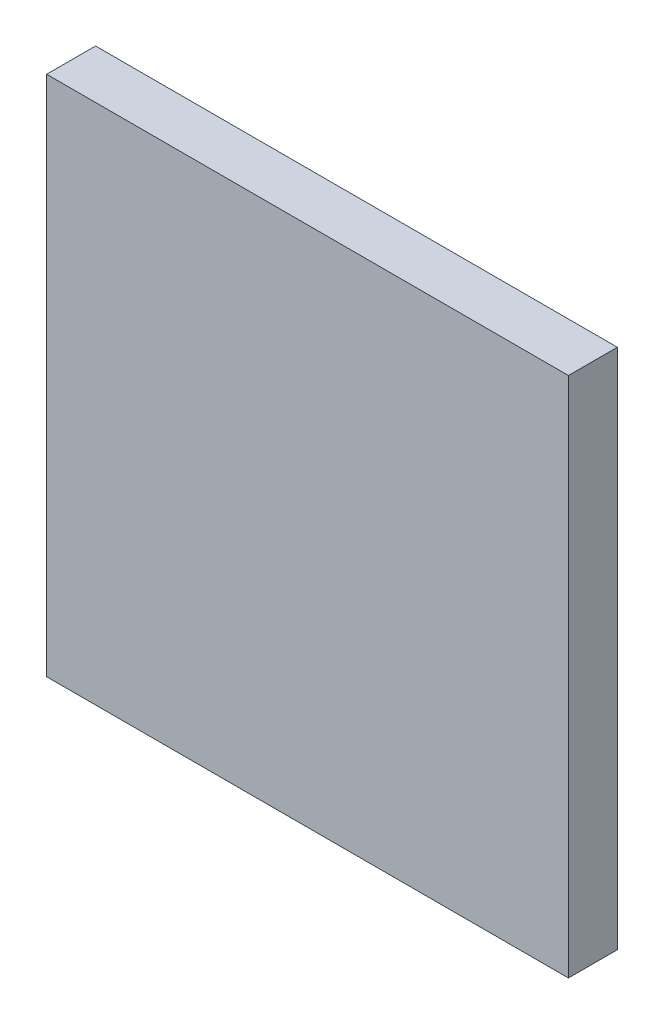
ISO-10303-21;
HEADER;
FILE_DESCRIPTION(('STEP AP214'),'2;1');
FILE_NAME('part.step','',(''),(''),'','','');
FILE_SCHEMA(('AUTOMOTIVE_DESIGN { 1 0 10303 214 1 1 1 1 }'));
ENDSEC;
DATA;
#1=APPLICATION_CONTEXT('core data for automotive mechanical design processes');
#2=APPLICATION_PROTOCOL_DEFINITION('international standard','automotive_design',2000,#1);
#3=PRODUCT_CONTEXT('',#1,'mechanical');
#4=PRODUCT('Part','Part','',(#3));
#5=PRODUCT_RELATED_PRODUCT_CATEGORY('part','',(#4));
#6=PRODUCT_DEFINITION_FORMATION('','',#4);
#7=PRODUCT_DEFINITION_CONTEXT('part definition',#1,'design');
#8=PRODUCT_DEFINITION('design','',#6,#7);
#9=PRODUCT_DEFINITION_SHAPE('','',#8);
#10=(LENGTH_UNIT() NAMED_UNIT(*) SI_UNIT(.MILLI.,.METRE.));
#11=(NAMED_UNIT(*) PLANE_ANGLE_UNIT() SI_UNIT($,.RADIAN.));
#12=(NAMED_UNIT(*) SI_UNIT($,.STERADIAN.) SOLID_ANGLE_UNIT());
#13=UNCERTAINTY_MEASURE_WITH_UNIT(LENGTH_MEASURE(1.E-05),#10,'distance_accuracy_value','');
#14=(GEOMETRIC_REPRESENTATION_CONTEXT(3) GLOBAL_UNCERTAINTY_ASSIGNED_CONTEXT((#13)) GLOBAL_UNIT_ASSIGNED_CONTEXT((#10,
#11,#12)) REPRESENTATION_CONTEXT('',''));
#15=CARTESIAN_POINT('',(0.,0.,0.));
#16=DIRECTION('',(0.,0.,1.));
#17=DIRECTION('',(1.,0.,0.));
#18=AXIS2_PLACEMENT_3D('',#15,#16,#17);
#19=CARTESIAN_POINT('',(0.,0.,3.75));
#20=DIRECTION('',(1.,0.,0.));
#21=DIRECTION('',(0.,0.,-1.));
#22=AXIS2_PLACEMENT_3D('',#19,#20,#21);
#23=PLANE('',#22);
#24=DIRECTION('',(0.,-1.,0.));
#25=VECTOR('',#24,1.);
#26=CARTESIAN_POINT('',(0.,0.,0.));
#27=LINE('',#26,#25);
#28=CARTESIAN_POINT('',(0.,40.,0.));
#29=VERTEX_POINT('',#28);
#30=CARTESIAN_POINT('',(0.,0.,0.));
#31=VERTEX_POINT('',#30);
#32=EDGE_CURVE('E95',#29,#31,#27,.T.);
#33=ORIENTED_EDGE('',*,*,#32,.T.);
#34=DIRECTION('',(0.,0.,-1.));
#35=VECTOR('',#34,1.);
#36=CARTESIAN_POINT('',(0.,0.,3.75));
#37=LINE('',#36,#35);
#38=CARTESIAN_POINT('',(0.,0.,3.75));
#39=VERTEX_POINT('',#38);
#40=EDGE_CURVE('E11',#39,#31,#37,.T.);
#41=ORIENTED_EDGE('',*,*,#40,.F.);
#42=DIRECTION('',(0.,-1.,0.));
#43=VECTOR('',#42,1.);
#44=CARTESIAN_POINT('',(0.,0.,3.75));
#45=LINE('',#44,#43);
#46=CARTESIAN_POINT('',(0.,40.,3.75));
#47=VERTEX_POINT('',#46);
#48=EDGE_CURVE('E83',#47,#39,#45,.T.);
#49=ORIENTED_EDGE('',*,*,#48,.F.);
#50=DIRECTION('',(0.,0.,-1.));
#51=VECTOR('',#50,1.);
#52=CARTESIAN_POINT('',(0.,40.,3.75));
#53=LINE('',#52,#51);
#54=EDGE_CURVE('E91',#47,#29,#53,.T.);
#55=ORIENTED_EDGE('',*,*,#54,.T.);
#56=EDGE_LOOP('',(#33,#41,#49,#55));
#57=FACE_BOUND('',#56,.T.);
#58=ADVANCED_FACE('F32',(#57),#23,.F.);
#59=CARTESIAN_POINT('',(0.,0.,3.75));
#60=DIRECTION('',(0.,1.,0.));
#61=DIRECTION('',(0.,0.,1.));
#62=AXIS2_PLACEMENT_3D('',#59,#60,#61);
#63=PLANE('',#62);
#64=DIRECTION('',(1.,0.,0.));
#65=VECTOR('',#64,1.);
#66=CARTESIAN_POINT('',(0.,0.,0.));
#67=LINE('',#66,#65);
#68=CARTESIAN_POINT('',(40.,0.,0.));
#69=VERTEX_POINT('',#68);
#70=EDGE_CURVE('E87',#31,#69,#67,.T.);
#71=ORIENTED_EDGE('',*,*,#70,.T.);
#72=DIRECTION('',(0.,0.,-1.));
#73=VECTOR('',#72,1.);
#74=CARTESIAN_POINT('',(40.,0.,3.75));
#75=LINE('',#74,#73);
#76=CARTESIAN_POINT('',(40.,0.,3.75));
#77=VERTEX_POINT('',#76);
#78=EDGE_CURVE('E40',#77,#69,#75,.T.);
#79=ORIENTED_EDGE('',*,*,#78,.F.);
#80=DIRECTION('',(1.,0.,0.));
#81=VECTOR('',#80,1.);
#82=CARTESIAN_POINT('',(0.,0.,3.75));
#83=LINE('',#82,#81);
#84=EDGE_CURVE('E78',#39,#77,#83,.T.);
#85=ORIENTED_EDGE('',*,*,#84,.F.);
#86=ORIENTED_EDGE('',*,*,#40,.T.);
#87=EDGE_LOOP('',(#71,#79,#85,#86));
#88=FACE_BOUND('',#87,.T.);
#89=ADVANCED_FACE('F86',(#88),#63,.F.);
#90=CARTESIAN_POINT('',(40.,0.,3.75));
#91=DIRECTION('',(-1.,0.,0.));
#92=DIRECTION('',(0.,0.,1.));
#93=AXIS2_PLACEMENT_3D('',#90,#91,#92);
#94=PLANE('',#93);
#95=DIRECTION('',(0.,1.,0.));
#96=VECTOR('',#95,1.);
#97=CARTESIAN_POINT('',(40.,0.,0.));
#98=LINE('',#97,#96);
#99=CARTESIAN_POINT('',(40.,40.,0.));
#100=VERTEX_POINT('',#99);
#101=EDGE_CURVE('E65',#69,#100,#98,.T.);
#102=ORIENTED_EDGE('',*,*,#101,.T.);
#103=DIRECTION('',(0.,0.,-1.));
#104=VECTOR('',#103,1.);
#105=CARTESIAN_POINT('',(40.,40.,3.75));
#106=LINE('',#105,#104);
#107=CARTESIAN_POINT('',(40.,40.,3.75));
#108=VERTEX_POINT('',#107);
#109=EDGE_CURVE('E88',#108,#100,#106,.T.);
#110=ORIENTED_EDGE('',*,*,#109,.F.);
#111=DIRECTION('',(0.,1.,0.));
#112=VECTOR('',#111,1.);
#113=CARTESIAN_POINT('',(40.,0.,3.75));
#114=LINE('',#113,#112);
#115=EDGE_CURVE('E81',#77,#108,#114,.T.);
#116=ORIENTED_EDGE('',*,*,#115,.F.);
#117=ORIENTED_EDGE('',*,*,#78,.T.);
#118=EDGE_LOOP('',(#102,#110,#116,#117));
#119=FACE_BOUND('',#118,.T.);
#120=ADVANCED_FACE('F89',(#119),#94,.F.);
#121=CARTESIAN_POINT('',(0.,40.,3.75));
#122=DIRECTION('',(0.,-1.,0.));
#123=DIRECTION('',(0.,0.,-1.));
#124=AXIS2_PLACEMENT_3D('',#121,#122,#123);
#125=PLANE('',#124);
#126=DIRECTION('',(-1.,0.,0.));
#127=VECTOR('',#126,1.);
#128=CARTESIAN_POINT('',(0.,40.,0.));
#129=LINE('',#128,#127);
#130=EDGE_CURVE('E71',#100,#29,#129,.T.);
#131=ORIENTED_EDGE('',*,*,#130,.T.);
#132=ORIENTED_EDGE('',*,*,#54,.F.);
#133=DIRECTION('',(-1.,0.,0.));
#134=VECTOR('',#133,1.);
#135=CARTESIAN_POINT('',(0.,40.,3.75));
#136=LINE('',#135,#134);
#137=EDGE_CURVE('E48',#108,#47,#136,.T.);
#138=ORIENTED_EDGE('',*,*,#137,.F.);
#139=ORIENTED_EDGE('',*,*,#109,.T.);
#140=EDGE_LOOP('',(#131,#132,#138,#139));
#141=FACE_BOUND('',#140,.T.);
#142=ADVANCED_FACE('F102',(#141),#125,.F.);
#143=CARTESIAN_POINT('',(0.,0.,3.75));
#144=DIRECTION('',(0.,0.,-1.));
#145=DIRECTION('',(-1.,0.,0.));
#146=AXIS2_PLACEMENT_3D('',#143,#144,#145);
#147=PLANE('',#146);
#148=ORIENTED_EDGE('',*,*,#48,.T.);
#149=ORIENTED_EDGE('',*,*,#84,.T.);
#150=ORIENTED_EDGE('',*,*,#115,.T.);
#151=ORIENTED_EDGE('',*,*,#137,.T.);
#152=EDGE_LOOP('',(#148,#149,#150,#151));
#153=FACE_BOUND('',#152,.T.);
#154=ADVANCED_FACE('F79',(#153),#147,.F.);
#155=CARTESIAN_POINT('',(0.,0.,0.));
#156=DIRECTION('',(0.,0.,-1.));
#157=DIRECTION('',(-1.,0.,0.));
#158=AXIS2_PLACEMENT_3D('',#155,#156,#157);
#159=PLANE('',#158);
#160=ORIENTED_EDGE('',*,*,#32,.F.);
#161=ORIENTED_EDGE('',*,*,#130,.F.);
#162=ORIENTED_EDGE('',*,*,#101,.F.);
#163=ORIENTED_EDGE('',*,*,#70,.F.);
#164=EDGE_LOOP('',(#160,#161,#162,#163));
#165=FACE_BOUND('',#164,.T.);
#166=ADVANCED_FACE('F105',(#165),#159,.T.);
#167=CLOSED_SHELL('',(#58,#89,#120,#142,#154,#166));
#168=MANIFOLD_SOLID_BREP('B2',#167);
#169=ADVANCED_BREP_SHAPE_REPRESENTATION('',(#18,#168),#14);
#170=SHAPE_DEFINITION_REPRESENTATION(#9,#169);
ENDSEC;
END-ISO-10303-21;
